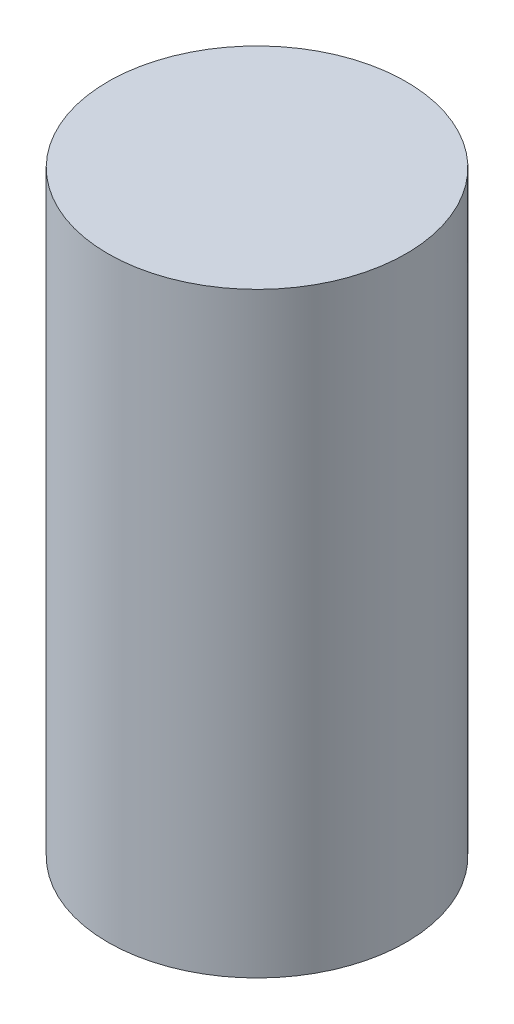
ISO-10303-21;
HEADER;
FILE_DESCRIPTION(('STEP AP214'),'2;1');
FILE_NAME('part.step','',(''),(''),'','','');
FILE_SCHEMA(('AUTOMOTIVE_DESIGN { 1 0 10303 214 1 1 1 1 }'));
ENDSEC;
DATA;
#1=APPLICATION_CONTEXT('core data for automotive mechanical design processes');
#2=APPLICATION_PROTOCOL_DEFINITION('international standard','automotive_design',2000,#1);
#3=PRODUCT_CONTEXT('',#1,'mechanical');
#4=PRODUCT('Part','Part','',(#3));
#5=PRODUCT_RELATED_PRODUCT_CATEGORY('part','',(#4));
#6=PRODUCT_DEFINITION_FORMATION('','',#4);
#7=PRODUCT_DEFINITION_CONTEXT('part definition',#1,'design');
#8=PRODUCT_DEFINITION('design','',#6,#7);
#9=PRODUCT_DEFINITION_SHAPE('','',#8);
#10=(LENGTH_UNIT() NAMED_UNIT(*) SI_UNIT(.MILLI.,.METRE.));
#11=(NAMED_UNIT(*) PLANE_ANGLE_UNIT() SI_UNIT($,.RADIAN.));
#12=(NAMED_UNIT(*) SI_UNIT($,.STERADIAN.) SOLID_ANGLE_UNIT());
#13=UNCERTAINTY_MEASURE_WITH_UNIT(LENGTH_MEASURE(1.E-05),#10,'distance_accuracy_value','');
#14=(GEOMETRIC_REPRESENTATION_CONTEXT(3) GLOBAL_UNCERTAINTY_ASSIGNED_CONTEXT((#13)) GLOBAL_UNIT_ASSIGNED_CONTEXT((#10,
#11,#12)) REPRESENTATION_CONTEXT('',''));
#15=CARTESIAN_POINT('',(0.,0.,0.));
#16=DIRECTION('',(0.,0.,1.));
#17=DIRECTION('',(1.,0.,0.));
#18=AXIS2_PLACEMENT_3D('',#15,#16,#17);
#19=CARTESIAN_POINT('',(0.,20.,0.));
#20=DIRECTION('',(0.,-1.,0.));
#21=DIRECTION('',(0.,0.,-1.));
#22=AXIS2_PLACEMENT_3D('',#19,#20,#21);
#23=CYLINDRICAL_SURFACE('',#22,5.);
#24=CARTESIAN_POINT('',(0.,20.,0.));
#25=DIRECTION('',(0.,1.,0.));
#26=DIRECTION('',(0.,0.,1.));
#27=AXIS2_PLACEMENT_3D('',#24,#25,#26);
#28=CIRCLE('',#27,5.);
#29=CARTESIAN_POINT('',(0.,20.,5.));
#30=VERTEX_POINT('',#29);
#31=EDGE_CURVE('E10',#30,#30,#28,.T.);
#32=ORIENTED_EDGE('',*,*,#31,.F.);
#33=EDGE_LOOP('',(#32));
#34=FACE_BOUND('',#33,.T.);
#35=CARTESIAN_POINT('',(0.,0.,0.));
#36=DIRECTION('',(0.,1.,0.));
#37=DIRECTION('',(0.,0.,1.));
#38=AXIS2_PLACEMENT_3D('',#35,#36,#37);
#39=CIRCLE('',#38,5.);
#40=CARTESIAN_POINT('',(0.,0.,5.));
#41=VERTEX_POINT('',#40);
#42=EDGE_CURVE('E41',#41,#41,#39,.T.);
#43=ORIENTED_EDGE('',*,*,#42,.T.);
#44=EDGE_LOOP('',(#43));
#45=FACE_BOUND('',#44,.T.);
#46=ADVANCED_FACE('F38',(#34,#45),#23,.T.);
#47=CARTESIAN_POINT('',(0.,20.,0.));
#48=DIRECTION('',(0.,1.,0.));
#49=DIRECTION('',(0.,0.,1.));
#50=AXIS2_PLACEMENT_3D('',#47,#48,#49);
#51=PLANE('',#50);
#52=ORIENTED_EDGE('',*,*,#31,.T.);
#53=EDGE_LOOP('',(#52));
#54=FACE_BOUND('',#53,.T.);
#55=ADVANCED_FACE('F59',(#54),#51,.T.);
#56=CARTESIAN_POINT('',(0.,0.,0.));
#57=DIRECTION('',(0.,1.,0.));
#58=DIRECTION('',(0.,0.,1.));
#59=AXIS2_PLACEMENT_3D('',#56,#57,#58);
#60=PLANE('',#59);
#61=ORIENTED_EDGE('',*,*,#42,.F.);
#62=EDGE_LOOP('',(#61));
#63=FACE_BOUND('',#62,.T.);
#64=ADVANCED_FACE('F57',(#63),#60,.F.);
#65=CLOSED_SHELL('',(#46,#55,#64));
#66=MANIFOLD_SOLID_BREP('B2',#65);
#67=ADVANCED_BREP_SHAPE_REPRESENTATION('',(#18,#66),#14);
#68=SHAPE_DEFINITION_REPRESENTATION(#9,#67);
ENDSEC;
END-ISO-10303-21;
